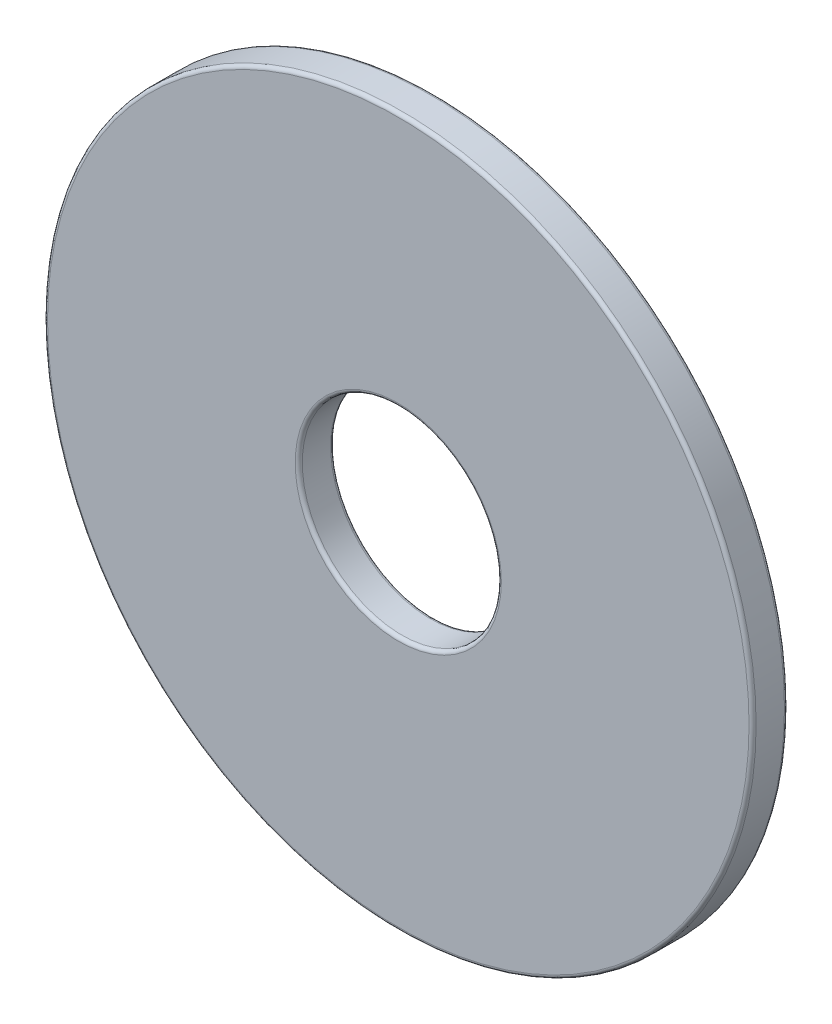
ISO-10303-21;
HEADER;
FILE_DESCRIPTION(('STEP AP214'),'2;1');
FILE_NAME('part.step','',(''),(''),'','','');
FILE_SCHEMA(('AUTOMOTIVE_DESIGN { 1 0 10303 214 1 1 1 1 }'));
ENDSEC;
DATA;
#1=APPLICATION_CONTEXT('core data for automotive mechanical design processes');
#2=APPLICATION_PROTOCOL_DEFINITION('international standard','automotive_design',2000,#1);
#3=PRODUCT_CONTEXT('',#1,'mechanical');
#4=PRODUCT('Part','Part','',(#3));
#5=PRODUCT_RELATED_PRODUCT_CATEGORY('part','',(#4));
#6=PRODUCT_DEFINITION_FORMATION('','',#4);
#7=PRODUCT_DEFINITION_CONTEXT('part definition',#1,'design');
#8=PRODUCT_DEFINITION('design','',#6,#7);
#9=PRODUCT_DEFINITION_SHAPE('','',#8);
#10=(LENGTH_UNIT() NAMED_UNIT(*) SI_UNIT(.MILLI.,.METRE.));
#11=(NAMED_UNIT(*) PLANE_ANGLE_UNIT() SI_UNIT($,.RADIAN.));
#12=(NAMED_UNIT(*) SI_UNIT($,.STERADIAN.) SOLID_ANGLE_UNIT());
#13=UNCERTAINTY_MEASURE_WITH_UNIT(LENGTH_MEASURE(1.E-05),#10,'distance_accuracy_value','');
#14=(GEOMETRIC_REPRESENTATION_CONTEXT(3) GLOBAL_UNCERTAINTY_ASSIGNED_CONTEXT((#13)) GLOBAL_UNIT_ASSIGNED_CONTEXT((#10,
#11,#12)) REPRESENTATION_CONTEXT('',''));
#15=CARTESIAN_POINT('',(0.,0.,0.));
#16=DIRECTION('',(0.,0.,1.));
#17=DIRECTION('',(1.,0.,0.));
#18=AXIS2_PLACEMENT_3D('',#15,#16,#17);
#19=CARTESIAN_POINT('',(0.,0.,-0.635000000000004));
#20=DIRECTION('',(0.,0.,1.));
#21=DIRECTION('',(1.,0.,0.));
#22=AXIS2_PLACEMENT_3D('',#19,#20,#21);
#23=CYLINDRICAL_SURFACE('',#22,12.7);
#24=CARTESIAN_POINT('',(0.,0.,0.508000000000006));
#25=DIRECTION('',(0.,0.,1.));
#26=DIRECTION('',(1.,0.,0.));
#27=AXIS2_PLACEMENT_3D('',#24,#25,#26);
#28=CIRCLE('',#27,12.7);
#29=CARTESIAN_POINT('',(12.7,0.,0.508000000000006));
#30=VERTEX_POINT('',#29);
#31=EDGE_CURVE('E10',#30,#30,#28,.F.);
#32=ORIENTED_EDGE('',*,*,#31,.T.);
#33=EDGE_LOOP('',(#32));
#34=FACE_BOUND('',#33,.T.);
#35=CARTESIAN_POINT('',(0.,0.,-0.508000000000004));
#36=DIRECTION('',(0.,0.,1.));
#37=DIRECTION('',(1.,0.,0.));
#38=AXIS2_PLACEMENT_3D('',#35,#36,#37);
#39=CIRCLE('',#38,12.7);
#40=CARTESIAN_POINT('',(12.7,0.,-0.508000000000004));
#41=VERTEX_POINT('',#40);
#42=EDGE_CURVE('E49',#41,#41,#39,.T.);
#43=ORIENTED_EDGE('',*,*,#42,.T.);
#44=EDGE_LOOP('',(#43));
#45=FACE_BOUND('',#44,.T.);
#46=ADVANCED_FACE('F41',(#34,#45),#23,.T.);
#47=CARTESIAN_POINT('',(0.,0.,-0.635000000000004));
#48=DIRECTION('',(0.,0.,1.));
#49=DIRECTION('',(1.,0.,0.));
#50=AXIS2_PLACEMENT_3D('',#47,#48,#49);
#51=PLANE('',#50);
#52=CARTESIAN_POINT('',(0.,0.,-0.635000000000004));
#53=DIRECTION('',(0.,0.,1.));
#54=DIRECTION('',(1.,0.,0.));
#55=AXIS2_PLACEMENT_3D('',#52,#53,#54);
#56=CIRCLE('',#55,3.6957);
#57=CARTESIAN_POINT('',(3.6957,0.,-0.635000000000004));
#58=VERTEX_POINT('',#57);
#59=EDGE_CURVE('E54',#58,#58,#56,.T.);
#60=ORIENTED_EDGE('',*,*,#59,.T.);
#61=EDGE_LOOP('',(#60));
#62=FACE_BOUND('',#61,.T.);
#63=CARTESIAN_POINT('',(0.,0.,-0.635000000000004));
#64=DIRECTION('',(0.,0.,1.));
#65=DIRECTION('',(1.,0.,0.));
#66=AXIS2_PLACEMENT_3D('',#63,#64,#65);
#67=CIRCLE('',#66,12.573);
#68=CARTESIAN_POINT('',(12.573,0.,-0.635000000000004));
#69=VERTEX_POINT('',#68);
#70=EDGE_CURVE('E59',#69,#69,#67,.F.);
#71=ORIENTED_EDGE('',*,*,#70,.T.);
#72=EDGE_LOOP('',(#71));
#73=FACE_BOUND('',#72,.T.);
#74=ADVANCED_FACE('F92',(#62,#73),#51,.F.);
#75=CARTESIAN_POINT('',(0.,0.,0.635000000000006));
#76=DIRECTION('',(0.,0.,1.));
#77=DIRECTION('',(1.,0.,0.));
#78=AXIS2_PLACEMENT_3D('',#75,#76,#77);
#79=PLANE('',#78);
#80=CARTESIAN_POINT('',(0.,0.,0.635000000000006));
#81=DIRECTION('',(0.,0.,1.));
#82=DIRECTION('',(1.,0.,0.));
#83=AXIS2_PLACEMENT_3D('',#80,#81,#82);
#84=CIRCLE('',#83,3.6957);
#85=CARTESIAN_POINT('',(3.6957,0.,0.635000000000006));
#86=VERTEX_POINT('',#85);
#87=EDGE_CURVE('E65',#86,#86,#84,.F.);
#88=ORIENTED_EDGE('',*,*,#87,.T.);
#89=EDGE_LOOP('',(#88));
#90=FACE_BOUND('',#89,.T.);
#91=CARTESIAN_POINT('',(0.,0.,0.635000000000006));
#92=DIRECTION('',(0.,0.,1.));
#93=DIRECTION('',(1.,0.,0.));
#94=AXIS2_PLACEMENT_3D('',#91,#92,#93);
#95=CIRCLE('',#94,12.573);
#96=CARTESIAN_POINT('',(12.573,0.,0.635000000000006));
#97=VERTEX_POINT('',#96);
#98=EDGE_CURVE('E69',#97,#97,#95,.T.);
#99=ORIENTED_EDGE('',*,*,#98,.T.);
#100=EDGE_LOOP('',(#99));
#101=FACE_BOUND('',#100,.T.);
#102=ADVANCED_FACE('F95',(#90,#101),#79,.T.);
#103=CARTESIAN_POINT('',(0.,0.,-0.635000000000004));
#104=DIRECTION('',(0.,0.,1.));
#105=DIRECTION('',(1.,0.,0.));
#106=AXIS2_PLACEMENT_3D('',#103,#104,#105);
#107=CYLINDRICAL_SURFACE('',#106,3.5687);
#108=CARTESIAN_POINT('',(0.,0.,0.508000000000006));
#109=DIRECTION('',(0.,0.,1.));
#110=DIRECTION('',(1.,0.,0.));
#111=AXIS2_PLACEMENT_3D('',#108,#109,#110);
#112=CIRCLE('',#111,3.5687);
#113=CARTESIAN_POINT('',(3.5687,0.,0.508000000000006));
#114=VERTEX_POINT('',#113);
#115=EDGE_CURVE('E73',#114,#114,#112,.T.);
#116=ORIENTED_EDGE('',*,*,#115,.T.);
#117=EDGE_LOOP('',(#116));
#118=FACE_BOUND('',#117,.T.);
#119=CARTESIAN_POINT('',(0.,0.,-0.508000000000004));
#120=DIRECTION('',(0.,0.,1.));
#121=DIRECTION('',(1.,0.,0.));
#122=AXIS2_PLACEMENT_3D('',#119,#120,#121);
#123=CIRCLE('',#122,3.5687);
#124=CARTESIAN_POINT('',(3.5687,0.,-0.508000000000004));
#125=VERTEX_POINT('',#124);
#126=EDGE_CURVE('E77',#125,#125,#123,.F.);
#127=ORIENTED_EDGE('',*,*,#126,.T.);
#128=EDGE_LOOP('',(#127));
#129=FACE_BOUND('',#128,.T.);
#130=ADVANCED_FACE('F82',(#118,#129),#107,.F.);
#131=CARTESIAN_POINT('',(0.,0.,0.508000000000006));
#132=DIRECTION('',(0.,0.,1.));
#133=DIRECTION('',(1.,0.,0.));
#134=AXIS2_PLACEMENT_3D('',#131,#132,#133);
#135=TOROIDAL_SURFACE('',#134,3.6957,0.127);
#136=ORIENTED_EDGE('',*,*,#87,.F.);
#137=EDGE_LOOP('',(#136));
#138=FACE_BOUND('',#137,.T.);
#139=ORIENTED_EDGE('',*,*,#115,.F.);
#140=EDGE_LOOP('',(#139));
#141=FACE_BOUND('',#140,.T.);
#142=ADVANCED_FACE('F88',(#138,#141),#135,.T.);
#143=CARTESIAN_POINT('',(0.,0.,-0.508000000000004));
#144=DIRECTION('',(0.,0.,1.));
#145=DIRECTION('',(1.,0.,0.));
#146=AXIS2_PLACEMENT_3D('',#143,#144,#145);
#147=TOROIDAL_SURFACE('',#146,3.6957,0.127);
#148=ORIENTED_EDGE('',*,*,#126,.F.);
#149=EDGE_LOOP('',(#148));
#150=FACE_BOUND('',#149,.T.);
#151=ORIENTED_EDGE('',*,*,#59,.F.);
#152=EDGE_LOOP('',(#151));
#153=FACE_BOUND('',#152,.T.);
#154=ADVANCED_FACE('F84',(#150,#153),#147,.T.);
#155=CARTESIAN_POINT('',(0.,0.,0.508000000000006));
#156=DIRECTION('',(0.,0.,1.));
#157=DIRECTION('',(1.,0.,0.));
#158=AXIS2_PLACEMENT_3D('',#155,#156,#157);
#159=TOROIDAL_SURFACE('',#158,12.573,0.127);
#160=ORIENTED_EDGE('',*,*,#31,.F.);
#161=EDGE_LOOP('',(#160));
#162=FACE_BOUND('',#161,.T.);
#163=ORIENTED_EDGE('',*,*,#98,.F.);
#164=EDGE_LOOP('',(#163));
#165=FACE_BOUND('',#164,.T.);
#166=ADVANCED_FACE('F87',(#162,#165),#159,.T.);
#167=CARTESIAN_POINT('',(0.,0.,-0.508000000000004));
#168=DIRECTION('',(0.,0.,1.));
#169=DIRECTION('',(1.,0.,0.));
#170=AXIS2_PLACEMENT_3D('',#167,#168,#169);
#171=TOROIDAL_SURFACE('',#170,12.573,0.127);
#172=ORIENTED_EDGE('',*,*,#70,.F.);
#173=EDGE_LOOP('',(#172));
#174=FACE_BOUND('',#173,.T.);
#175=ORIENTED_EDGE('',*,*,#42,.F.);
#176=EDGE_LOOP('',(#175));
#177=FACE_BOUND('',#176,.T.);
#178=ADVANCED_FACE('F43',(#174,#177),#171,.T.);
#179=CLOSED_SHELL('',(#46,#74,#102,#130,#142,#154,#166,#178));
#180=MANIFOLD_SOLID_BREP('B2',#179);
#181=ADVANCED_BREP_SHAPE_REPRESENTATION('',(#18,#180),#14);
#182=SHAPE_DEFINITION_REPRESENTATION(#9,#181);
ENDSEC;
END-ISO-10303-21;
